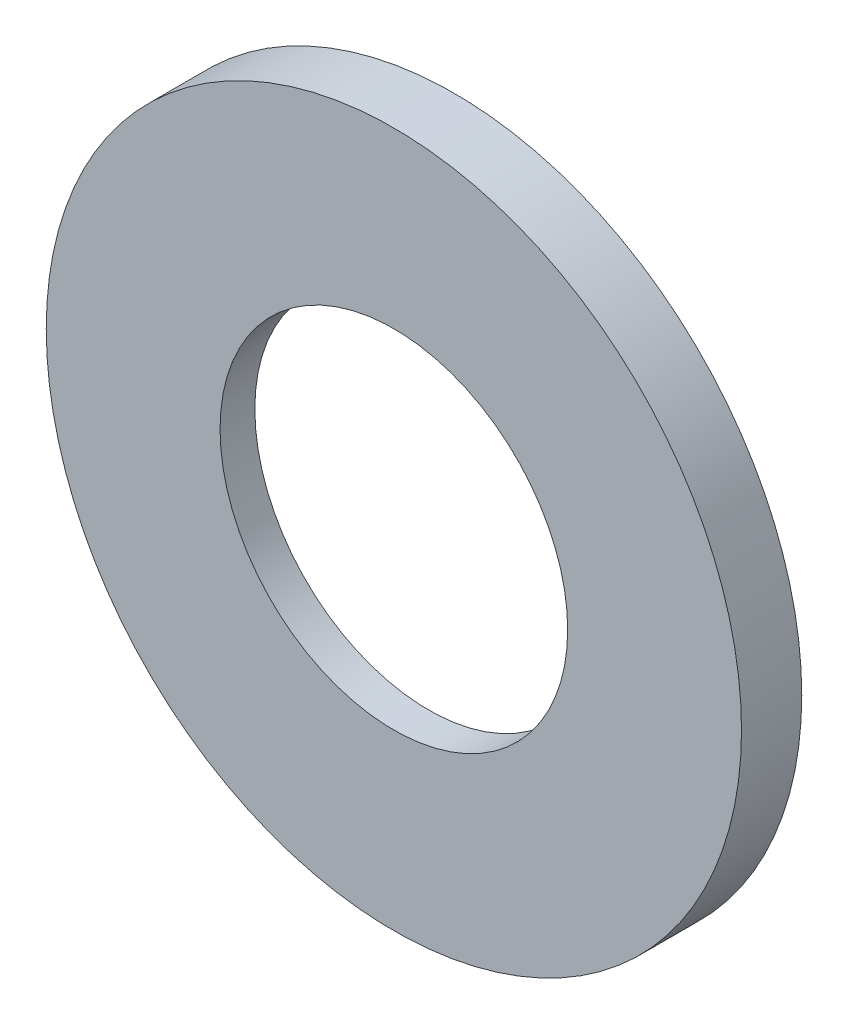
ISO-10303-21;
HEADER;
FILE_DESCRIPTION(('STEP AP214'),'2;1');
FILE_NAME('part.step','',(''),(''),'','','');
FILE_SCHEMA(('AUTOMOTIVE_DESIGN { 1 0 10303 214 1 1 1 1 }'));
ENDSEC;
DATA;
#1=APPLICATION_CONTEXT('core data for automotive mechanical design processes');
#2=APPLICATION_PROTOCOL_DEFINITION('international standard','automotive_design',2000,#1);
#3=PRODUCT_CONTEXT('',#1,'mechanical');
#4=PRODUCT('Part','Part','',(#3));
#5=PRODUCT_RELATED_PRODUCT_CATEGORY('part','',(#4));
#6=PRODUCT_DEFINITION_FORMATION('','',#4);
#7=PRODUCT_DEFINITION_CONTEXT('part definition',#1,'design');
#8=PRODUCT_DEFINITION('design','',#6,#7);
#9=PRODUCT_DEFINITION_SHAPE('','',#8);
#10=(LENGTH_UNIT() NAMED_UNIT(*) SI_UNIT(.MILLI.,.METRE.));
#11=(NAMED_UNIT(*) PLANE_ANGLE_UNIT() SI_UNIT($,.RADIAN.));
#12=(NAMED_UNIT(*) SI_UNIT($,.STERADIAN.) SOLID_ANGLE_UNIT());
#13=UNCERTAINTY_MEASURE_WITH_UNIT(LENGTH_MEASURE(1.E-05),#10,'distance_accuracy_value','');
#14=(GEOMETRIC_REPRESENTATION_CONTEXT(3) GLOBAL_UNCERTAINTY_ASSIGNED_CONTEXT((#13)) GLOBAL_UNIT_ASSIGNED_CONTEXT((#10,
#11,#12)) REPRESENTATION_CONTEXT('',''));
#15=CARTESIAN_POINT('',(0.,0.,0.));
#16=DIRECTION('',(0.,0.,1.));
#17=DIRECTION('',(1.,0.,0.));
#18=AXIS2_PLACEMENT_3D('',#15,#16,#17);
#19=CARTESIAN_POINT('',(0.,0.,30.));
#20=DIRECTION('',(0.,0.,-1.));
#21=DIRECTION('',(-1.,0.,0.));
#22=AXIS2_PLACEMENT_3D('',#19,#20,#21);
#23=CYLINDRICAL_SURFACE('',#22,75.);
#24=CARTESIAN_POINT('',(0.,0.,0.));
#25=DIRECTION('',(0.,0.,1.));
#26=DIRECTION('',(1.,0.,0.));
#27=AXIS2_PLACEMENT_3D('',#24,#25,#26);
#28=CIRCLE('',#27,75.);
#29=CARTESIAN_POINT('',(75.,0.,0.));
#30=VERTEX_POINT('',#29);
#31=EDGE_CURVE('E43',#30,#30,#28,.T.);
#32=ORIENTED_EDGE('',*,*,#31,.T.);
#33=EDGE_LOOP('',(#32));
#34=FACE_BOUND('',#33,.T.);
#35=CARTESIAN_POINT('',(0.,0.,13.));
#36=DIRECTION('',(0.,0.,1.));
#37=DIRECTION('',(1.,0.,0.));
#38=AXIS2_PLACEMENT_3D('',#35,#36,#37);
#39=CIRCLE('',#38,75.);
#40=CARTESIAN_POINT('',(75.,0.,13.));
#41=VERTEX_POINT('',#40);
#42=EDGE_CURVE('E67',#41,#41,#39,.T.);
#43=ORIENTED_EDGE('',*,*,#42,.F.);
#44=EDGE_LOOP('',(#43));
#45=FACE_BOUND('',#44,.T.);
#46=ADVANCED_FACE('F36',(#34,#45),#23,.T.);
#47=CARTESIAN_POINT('',(0.,0.,10.5));
#48=DIRECTION('',(0.,0.,1.));
#49=DIRECTION('',(1.,0.,0.));
#50=AXIS2_PLACEMENT_3D('',#47,#48,#49);
#51=CYLINDRICAL_SURFACE('',#50,37.5);
#52=CARTESIAN_POINT('',(0.,0.,5.5));
#53=DIRECTION('',(0.,0.,-1.));
#54=DIRECTION('',(-1.,0.,0.));
#55=AXIS2_PLACEMENT_3D('',#52,#53,#54);
#56=CIRCLE('',#55,37.5);
#57=CARTESIAN_POINT('',(-37.5,0.,5.5));
#58=VERTEX_POINT('',#57);
#59=EDGE_CURVE('E63',#58,#58,#56,.T.);
#60=ORIENTED_EDGE('',*,*,#59,.T.);
#61=EDGE_LOOP('',(#60));
#62=FACE_BOUND('',#61,.T.);
#63=CARTESIAN_POINT('',(0.,0.,13.));
#64=DIRECTION('',(0.,0.,1.));
#65=DIRECTION('',(1.,0.,0.));
#66=AXIS2_PLACEMENT_3D('',#63,#64,#65);
#67=CIRCLE('',#66,37.5);
#68=CARTESIAN_POINT('',(37.5,0.,13.));
#69=VERTEX_POINT('',#68);
#70=EDGE_CURVE('E71',#69,#69,#67,.T.);
#71=ORIENTED_EDGE('',*,*,#70,.T.);
#72=EDGE_LOOP('',(#71));
#73=FACE_BOUND('',#72,.T.);
#74=ADVANCED_FACE('F76',(#62,#73),#51,.F.);
#75=CARTESIAN_POINT('',(0.,0.,10.5));
#76=DIRECTION('',(0.,0.,1.));
#77=DIRECTION('',(1.,0.,0.));
#78=AXIS2_PLACEMENT_3D('',#75,#76,#77);
#79=PLANE('',#78);
#80=CARTESIAN_POINT('',(0.,0.,10.5));
#81=DIRECTION('',(0.,0.,1.));
#82=DIRECTION('',(1.,0.,0.));
#83=AXIS2_PLACEMENT_3D('',#80,#81,#82);
#84=CIRCLE('',#83,52.5);
#85=CARTESIAN_POINT('',(52.5,0.,10.5));
#86=VERTEX_POINT('',#85);
#87=EDGE_CURVE('E53',#86,#86,#84,.T.);
#88=ORIENTED_EDGE('',*,*,#87,.F.);
#89=EDGE_LOOP('',(#88));
#90=FACE_BOUND('',#89,.T.);
#91=CARTESIAN_POINT('',(0.,0.,10.5));
#92=DIRECTION('',(0.,0.,1.));
#93=DIRECTION('',(1.,0.,0.));
#94=AXIS2_PLACEMENT_3D('',#91,#92,#93);
#95=CIRCLE('',#94,42.5);
#96=CARTESIAN_POINT('',(42.5,0.,10.5));
#97=VERTEX_POINT('',#96);
#98=EDGE_CURVE('E10',#97,#97,#95,.F.);
#99=ORIENTED_EDGE('',*,*,#98,.F.);
#100=EDGE_LOOP('',(#99));
#101=FACE_BOUND('',#100,.T.);
#102=ADVANCED_FACE('F90',(#90,#101),#79,.F.);
#103=CARTESIAN_POINT('',(0.,0.,30.));
#104=DIRECTION('',(0.,0.,-1.));
#105=DIRECTION('',(-1.,0.,0.));
#106=AXIS2_PLACEMENT_3D('',#103,#104,#105);
#107=CYLINDRICAL_SURFACE('',#106,52.5);
#108=CARTESIAN_POINT('',(0.,0.,0.));
#109=DIRECTION('',(0.,0.,1.));
#110=DIRECTION('',(1.,0.,0.));
#111=AXIS2_PLACEMENT_3D('',#108,#109,#110);
#112=CIRCLE('',#111,52.5);
#113=CARTESIAN_POINT('',(52.5,0.,0.));
#114=VERTEX_POINT('',#113);
#115=EDGE_CURVE('E48',#114,#114,#112,.T.);
#116=ORIENTED_EDGE('',*,*,#115,.F.);
#117=EDGE_LOOP('',(#116));
#118=FACE_BOUND('',#117,.T.);
#119=ORIENTED_EDGE('',*,*,#87,.T.);
#120=EDGE_LOOP('',(#119));
#121=FACE_BOUND('',#120,.T.);
#122=ADVANCED_FACE('F97',(#118,#121),#107,.F.);
#123=CARTESIAN_POINT('',(0.,0.,0.));
#124=DIRECTION('',(0.,0.,1.));
#125=DIRECTION('',(1.,0.,0.));
#126=AXIS2_PLACEMENT_3D('',#123,#124,#125);
#127=PLANE('',#126);
#128=ORIENTED_EDGE('',*,*,#31,.F.);
#129=EDGE_LOOP('',(#128));
#130=FACE_BOUND('',#129,.T.);
#131=ORIENTED_EDGE('',*,*,#115,.T.);
#132=EDGE_LOOP('',(#131));
#133=FACE_BOUND('',#132,.T.);
#134=ADVANCED_FACE('F104',(#130,#133),#127,.F.);
#135=CARTESIAN_POINT('',(0.,0.,5.5));
#136=DIRECTION('',(0.,0.,-1.));
#137=DIRECTION('',(-1.,0.,0.));
#138=AXIS2_PLACEMENT_3D('',#135,#136,#137);
#139=PLANE('',#138);
#140=CARTESIAN_POINT('',(0.,0.,5.5));
#141=DIRECTION('',(0.,0.,-1.));
#142=DIRECTION('',(-1.,0.,0.));
#143=AXIS2_PLACEMENT_3D('',#140,#141,#142);
#144=CIRCLE('',#143,42.5);
#145=CARTESIAN_POINT('',(-42.5,0.,5.5));
#146=VERTEX_POINT('',#145);
#147=EDGE_CURVE('E59',#146,#146,#144,.T.);
#148=ORIENTED_EDGE('',*,*,#147,.T.);
#149=EDGE_LOOP('',(#148));
#150=FACE_BOUND('',#149,.T.);
#151=ORIENTED_EDGE('',*,*,#59,.F.);
#152=EDGE_LOOP('',(#151));
#153=FACE_BOUND('',#152,.T.);
#154=ADVANCED_FACE('F107',(#150,#153),#139,.T.);
#155=CARTESIAN_POINT('',(0.,0.,5.5));
#156=DIRECTION('',(0.,0.,1.));
#157=DIRECTION('',(1.,0.,0.));
#158=AXIS2_PLACEMENT_3D('',#155,#156,#157);
#159=CYLINDRICAL_SURFACE('',#158,42.5);
#160=ORIENTED_EDGE('',*,*,#147,.F.);
#161=EDGE_LOOP('',(#160));
#162=FACE_BOUND('',#161,.T.);
#163=ORIENTED_EDGE('',*,*,#98,.T.);
#164=EDGE_LOOP('',(#163));
#165=FACE_BOUND('',#164,.T.);
#166=ADVANCED_FACE('F81',(#162,#165),#159,.T.);
#167=CARTESIAN_POINT('',(0.,0.,13.));
#168=DIRECTION('',(0.,0.,1.));
#169=DIRECTION('',(1.,0.,0.));
#170=AXIS2_PLACEMENT_3D('',#167,#168,#169);
#171=PLANE('',#170);
#172=ORIENTED_EDGE('',*,*,#70,.F.);
#173=EDGE_LOOP('',(#172));
#174=FACE_BOUND('',#173,.T.);
#175=ORIENTED_EDGE('',*,*,#42,.T.);
#176=EDGE_LOOP('',(#175));
#177=FACE_BOUND('',#176,.T.);
#178=ADVANCED_FACE('F78',(#174,#177),#171,.T.);
#179=CLOSED_SHELL('',(#46,#74,#102,#122,#134,#154,#166,#178));
#180=MANIFOLD_SOLID_BREP('B2',#179);
#181=ADVANCED_BREP_SHAPE_REPRESENTATION('',(#18,#180),#14);
#182=SHAPE_DEFINITION_REPRESENTATION(#9,#181);
ENDSEC;
END-ISO-10303-21;
